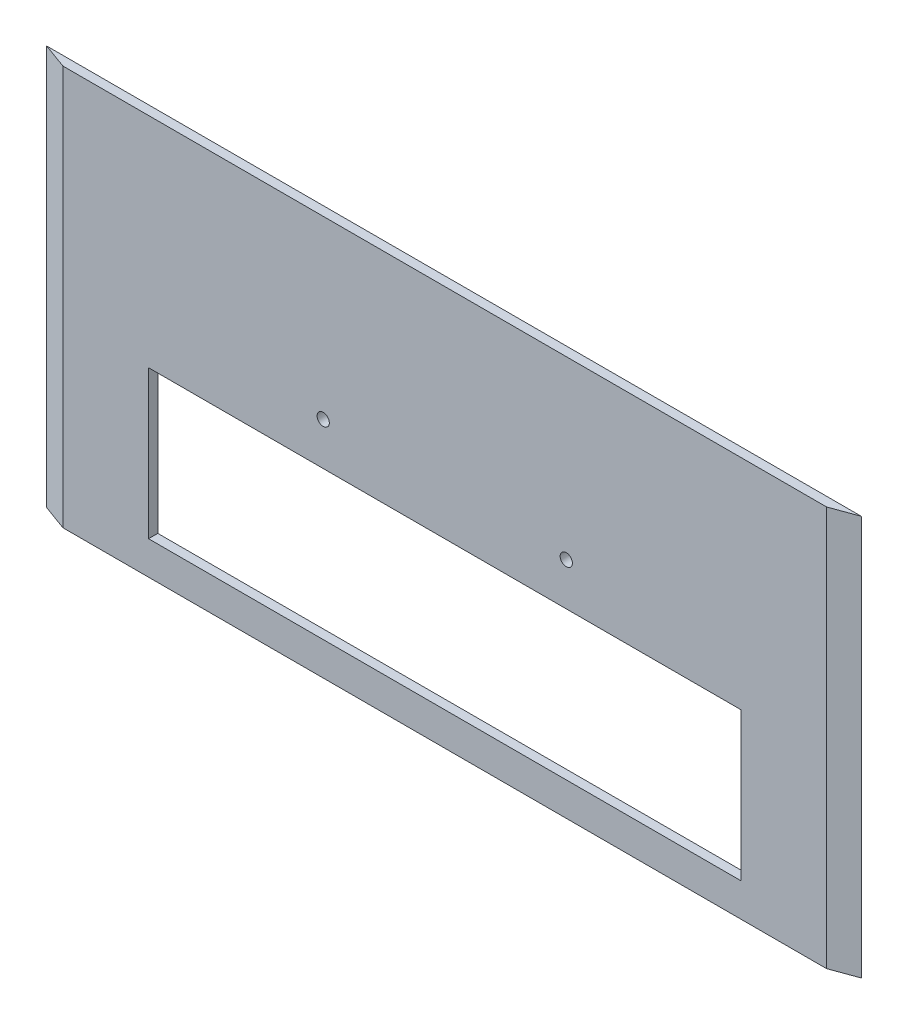
ISO-10303-21;
HEADER;
FILE_DESCRIPTION(('STEP AP214'),'2;1');
FILE_NAME('part.step','',(''),(''),'','','');
FILE_SCHEMA(('AUTOMOTIVE_DESIGN { 1 0 10303 214 1 1 1 1 }'));
ENDSEC;
DATA;
#1=APPLICATION_CONTEXT('core data for automotive mechanical design processes');
#2=APPLICATION_PROTOCOL_DEFINITION('international standard','automotive_design',2000,#1);
#3=PRODUCT_CONTEXT('',#1,'mechanical');
#4=PRODUCT('Part','Part','',(#3));
#5=PRODUCT_RELATED_PRODUCT_CATEGORY('part','',(#4));
#6=PRODUCT_DEFINITION_FORMATION('','',#4);
#7=PRODUCT_DEFINITION_CONTEXT('part definition',#1,'design');
#8=PRODUCT_DEFINITION('design','',#6,#7);
#9=PRODUCT_DEFINITION_SHAPE('','',#8);
#10=(LENGTH_UNIT() NAMED_UNIT(*) SI_UNIT(.MILLI.,.METRE.));
#11=(NAMED_UNIT(*) PLANE_ANGLE_UNIT() SI_UNIT($,.RADIAN.));
#12=(NAMED_UNIT(*) SI_UNIT($,.STERADIAN.) SOLID_ANGLE_UNIT());
#13=UNCERTAINTY_MEASURE_WITH_UNIT(LENGTH_MEASURE(1.E-05),#10,'distance_accuracy_value','');
#14=(GEOMETRIC_REPRESENTATION_CONTEXT(3) GLOBAL_UNCERTAINTY_ASSIGNED_CONTEXT((#13)) GLOBAL_UNIT_ASSIGNED_CONTEXT((#10,
#11,#12)) REPRESENTATION_CONTEXT('',''));
#15=CARTESIAN_POINT('',(0.,0.,0.));
#16=DIRECTION('',(0.,0.,1.));
#17=DIRECTION('',(1.,0.,0.));
#18=AXIS2_PLACEMENT_3D('',#15,#16,#17);
#19=CARTESIAN_POINT('',(-87.5,-31.5,2.5));
#20=DIRECTION('',(0.,1.,0.));
#21=DIRECTION('',(0.,0.,1.));
#22=AXIS2_PLACEMENT_3D('',#19,#20,#21);
#23=PLANE('',#22);
#24=DIRECTION('',(1.,0.,0.));
#25=VECTOR('',#24,1.);
#26=CARTESIAN_POINT('',(-87.5,-31.5,0.));
#27=LINE('',#26,#25);
#28=CARTESIAN_POINT('',(-110.,-31.5,0.));
#29=VERTEX_POINT('',#28);
#30=CARTESIAN_POINT('',(110.,-31.5,0.));
#31=VERTEX_POINT('',#30);
#32=EDGE_CURVE('E46',#29,#31,#27,.T.);
#33=ORIENTED_EDGE('',*,*,#32,.T.);
#34=DIRECTION('',(-0.939692620785911,0.,0.342020143325663));
#35=VECTOR('',#34,1.);
#36=CARTESIAN_POINT('',(103.131306451363,-31.5,2.5));
#37=LINE('',#36,#35);
#38=CARTESIAN_POINT('',(103.131306451363,-31.5,2.5));
#39=VERTEX_POINT('',#38);
#40=EDGE_CURVE('E129',#31,#39,#37,.T.);
#41=ORIENTED_EDGE('',*,*,#40,.T.);
#42=DIRECTION('',(1.,0.,0.));
#43=VECTOR('',#42,1.);
#44=CARTESIAN_POINT('',(-87.5,-31.5,2.5));
#45=LINE('',#44,#43);
#46=CARTESIAN_POINT('',(-103.131306451363,-31.5,2.5));
#47=VERTEX_POINT('',#46);
#48=EDGE_CURVE('E11',#47,#39,#45,.T.);
#49=ORIENTED_EDGE('',*,*,#48,.F.);
#50=DIRECTION('',(0.939692620785911,0.,0.342020143325663));
#51=VECTOR('',#50,1.);
#52=CARTESIAN_POINT('',(-103.131306451363,-31.5,2.5));
#53=LINE('',#52,#51);
#54=EDGE_CURVE('E135',#29,#47,#53,.T.);
#55=ORIENTED_EDGE('',*,*,#54,.F.);
#56=EDGE_LOOP('',(#33,#41,#49,#55));
#57=FACE_BOUND('',#56,.T.);
#58=ADVANCED_FACE('F43',(#57),#23,.F.);
#59=CARTESIAN_POINT('',(0.,0.,2.5));
#60=DIRECTION('',(0.,0.,-1.));
#61=DIRECTION('',(-1.,0.,0.));
#62=AXIS2_PLACEMENT_3D('',#59,#60,#61);
#63=PLANE('',#62);
#64=CARTESIAN_POINT('',(-32.825,29.0000000000001,2.5));
#65=DIRECTION('',(0.,0.,1.));
#66=DIRECTION('',(1.,0.,0.));
#67=AXIS2_PLACEMENT_3D('',#64,#65,#66);
#68=CIRCLE('',#67,1.65);
#69=CARTESIAN_POINT('',(-31.175,29.0000000000001,2.5));
#70=VERTEX_POINT('',#69);
#71=EDGE_CURVE('E230',#70,#70,#68,.T.);
#72=ORIENTED_EDGE('',*,*,#71,.F.);
#73=EDGE_LOOP('',(#72));
#74=FACE_BOUND('',#73,.T.);
#75=CARTESIAN_POINT('',(32.825,29.0000000000001,2.5));
#76=DIRECTION('',(0.,0.,-1.));
#77=DIRECTION('',(-1.,0.,0.));
#78=AXIS2_PLACEMENT_3D('',#75,#76,#77);
#79=CIRCLE('',#78,1.65);
#80=CARTESIAN_POINT('',(31.175,29.0000000000001,2.5));
#81=VERTEX_POINT('',#80);
#82=EDGE_CURVE('E131',#81,#81,#79,.T.);
#83=ORIENTED_EDGE('',*,*,#82,.T.);
#84=EDGE_LOOP('',(#83));
#85=FACE_BOUND('',#84,.T.);
#86=DIRECTION('',(-1.,0.,0.));
#87=VECTOR('',#86,1.);
#88=CARTESIAN_POINT('',(-80.,17.5,2.5));
#89=LINE('',#88,#87);
#90=CARTESIAN_POINT('',(80.,17.5,2.5));
#91=VERTEX_POINT('',#90);
#92=CARTESIAN_POINT('',(-80.,17.5,2.5));
#93=VERTEX_POINT('',#92);
#94=EDGE_CURVE('E158',#91,#93,#89,.T.);
#95=ORIENTED_EDGE('',*,*,#94,.F.);
#96=DIRECTION('',(0.,1.,0.));
#97=VECTOR('',#96,1.);
#98=CARTESIAN_POINT('',(80.,-22.5,2.5));
#99=LINE('',#98,#97);
#100=CARTESIAN_POINT('',(80.,-22.5,2.5));
#101=VERTEX_POINT('',#100);
#102=EDGE_CURVE('E57',#101,#91,#99,.T.);
#103=ORIENTED_EDGE('',*,*,#102,.F.);
#104=DIRECTION('',(1.,0.,0.));
#105=VECTOR('',#104,1.);
#106=CARTESIAN_POINT('',(-80.,-22.5,2.5));
#107=LINE('',#106,#105);
#108=CARTESIAN_POINT('',(-80.,-22.5,2.5));
#109=VERTEX_POINT('',#108);
#110=EDGE_CURVE('E149',#109,#101,#107,.T.);
#111=ORIENTED_EDGE('',*,*,#110,.F.);
#112=DIRECTION('',(0.,-1.,0.));
#113=VECTOR('',#112,1.);
#114=CARTESIAN_POINT('',(-80.,-22.5,2.5));
#115=LINE('',#114,#113);
#116=EDGE_CURVE('E161',#93,#109,#115,.T.);
#117=ORIENTED_EDGE('',*,*,#116,.F.);
#118=EDGE_LOOP('',(#95,#103,#111,#117));
#119=FACE_BOUND('',#118,.T.);
#120=ORIENTED_EDGE('',*,*,#48,.T.);
#121=DIRECTION('',(0.,-1.,0.));
#122=VECTOR('',#121,1.);
#123=CARTESIAN_POINT('',(103.131306451363,99.1384628453435,2.5));
#124=LINE('',#123,#122);
#125=CARTESIAN_POINT('',(103.131306451363,76.5,2.5));
#126=VERTEX_POINT('',#125);
#127=EDGE_CURVE('E125',#126,#39,#124,.T.);
#128=ORIENTED_EDGE('',*,*,#127,.F.);
#129=DIRECTION('',(-1.,0.,0.));
#130=VECTOR('',#129,1.);
#131=CARTESIAN_POINT('',(-87.5,76.5,2.5));
#132=LINE('',#131,#130);
#133=CARTESIAN_POINT('',(-103.131306451363,76.5,2.5));
#134=VERTEX_POINT('',#133);
#135=EDGE_CURVE('E117',#126,#134,#132,.T.);
#136=ORIENTED_EDGE('',*,*,#135,.T.);
#137=DIRECTION('',(0.,-1.,0.));
#138=VECTOR('',#137,1.);
#139=CARTESIAN_POINT('',(-103.131306451363,99.1384628453435,2.5));
#140=LINE('',#139,#138);
#141=EDGE_CURVE('E138',#134,#47,#140,.T.);
#142=ORIENTED_EDGE('',*,*,#141,.T.);
#143=EDGE_LOOP('',(#120,#128,#136,#142));
#144=FACE_BOUND('',#143,.T.);
#145=ADVANCED_FACE('F179',(#74,#85,#119,#144),#63,.F.);
#146=CARTESIAN_POINT('',(0.,0.,0.));
#147=DIRECTION('',(0.,0.,-1.));
#148=DIRECTION('',(-1.,0.,0.));
#149=AXIS2_PLACEMENT_3D('',#146,#147,#148);
#150=PLANE('',#149);
#151=CARTESIAN_POINT('',(-32.825,29.0000000000001,0.));
#152=DIRECTION('',(0.,0.,1.));
#153=DIRECTION('',(1.,0.,0.));
#154=AXIS2_PLACEMENT_3D('',#151,#152,#153);
#155=CIRCLE('',#154,1.65);
#156=CARTESIAN_POINT('',(-31.175,29.0000000000001,0.));
#157=VERTEX_POINT('',#156);
#158=EDGE_CURVE('E233',#157,#157,#155,.T.);
#159=ORIENTED_EDGE('',*,*,#158,.T.);
#160=EDGE_LOOP('',(#159));
#161=FACE_BOUND('',#160,.T.);
#162=CARTESIAN_POINT('',(32.825,29.0000000000001,0.));
#163=DIRECTION('',(0.,0.,-1.));
#164=DIRECTION('',(-1.,0.,0.));
#165=AXIS2_PLACEMENT_3D('',#162,#163,#164);
#166=CIRCLE('',#165,1.65);
#167=CARTESIAN_POINT('',(31.175,29.0000000000001,0.));
#168=VERTEX_POINT('',#167);
#169=EDGE_CURVE('E236',#168,#168,#166,.T.);
#170=ORIENTED_EDGE('',*,*,#169,.F.);
#171=EDGE_LOOP('',(#170));
#172=FACE_BOUND('',#171,.T.);
#173=DIRECTION('',(0.,1.,0.));
#174=VECTOR('',#173,1.);
#175=CARTESIAN_POINT('',(80.,-22.5,0.));
#176=LINE('',#175,#174);
#177=CARTESIAN_POINT('',(80.,-22.5,0.));
#178=VERTEX_POINT('',#177);
#179=CARTESIAN_POINT('',(80.,17.5,0.));
#180=VERTEX_POINT('',#179);
#181=EDGE_CURVE('E145',#178,#180,#176,.T.);
#182=ORIENTED_EDGE('',*,*,#181,.T.);
#183=DIRECTION('',(-1.,0.,0.));
#184=VECTOR('',#183,1.);
#185=CARTESIAN_POINT('',(-80.,17.5,0.));
#186=LINE('',#185,#184);
#187=CARTESIAN_POINT('',(-80.,17.5,0.));
#188=VERTEX_POINT('',#187);
#189=EDGE_CURVE('E148',#180,#188,#186,.T.);
#190=ORIENTED_EDGE('',*,*,#189,.T.);
#191=DIRECTION('',(0.,-1.,0.));
#192=VECTOR('',#191,1.);
#193=CARTESIAN_POINT('',(-80.,-22.5,0.));
#194=LINE('',#193,#192);
#195=CARTESIAN_POINT('',(-80.,-22.5,0.));
#196=VERTEX_POINT('',#195);
#197=EDGE_CURVE('E65',#188,#196,#194,.T.);
#198=ORIENTED_EDGE('',*,*,#197,.T.);
#199=DIRECTION('',(1.,0.,0.));
#200=VECTOR('',#199,1.);
#201=CARTESIAN_POINT('',(-80.,-22.5,0.));
#202=LINE('',#201,#200);
#203=EDGE_CURVE('E153',#196,#178,#202,.T.);
#204=ORIENTED_EDGE('',*,*,#203,.T.);
#205=EDGE_LOOP('',(#182,#190,#198,#204));
#206=FACE_BOUND('',#205,.T.);
#207=DIRECTION('',(-1.,0.,0.));
#208=VECTOR('',#207,1.);
#209=CARTESIAN_POINT('',(-87.5,76.5,0.));
#210=LINE('',#209,#208);
#211=CARTESIAN_POINT('',(110.,76.5,0.));
#212=VERTEX_POINT('',#211);
#213=CARTESIAN_POINT('',(-110.,76.5,0.));
#214=VERTEX_POINT('',#213);
#215=EDGE_CURVE('E106',#212,#214,#210,.T.);
#216=ORIENTED_EDGE('',*,*,#215,.F.);
#217=DIRECTION('',(0.,-1.,0.));
#218=VECTOR('',#217,1.);
#219=CARTESIAN_POINT('',(110.,99.1384628453435,0.));
#220=LINE('',#219,#218);
#221=EDGE_CURVE('E110',#212,#31,#220,.T.);
#222=ORIENTED_EDGE('',*,*,#221,.T.);
#223=ORIENTED_EDGE('',*,*,#32,.F.);
#224=DIRECTION('',(0.,-1.,0.));
#225=VECTOR('',#224,1.);
#226=CARTESIAN_POINT('',(-110.,99.1384628453435,0.));
#227=LINE('',#226,#225);
#228=EDGE_CURVE('E113',#214,#29,#227,.T.);
#229=ORIENTED_EDGE('',*,*,#228,.F.);
#230=EDGE_LOOP('',(#216,#222,#223,#229));
#231=FACE_BOUND('',#230,.T.);
#232=ADVANCED_FACE('F108',(#161,#172,#206,#231),#150,.T.);
#233=CARTESIAN_POINT('',(80.,-22.5,0.));
#234=DIRECTION('',(1.,0.,0.));
#235=DIRECTION('',(0.,0.,-1.));
#236=AXIS2_PLACEMENT_3D('',#233,#234,#235);
#237=PLANE('',#236);
#238=ORIENTED_EDGE('',*,*,#102,.T.);
#239=DIRECTION('',(0.,0.,1.));
#240=VECTOR('',#239,1.);
#241=CARTESIAN_POINT('',(80.,17.5,0.));
#242=LINE('',#241,#240);
#243=EDGE_CURVE('E156',#180,#91,#242,.T.);
#244=ORIENTED_EDGE('',*,*,#243,.F.);
#245=ORIENTED_EDGE('',*,*,#181,.F.);
#246=DIRECTION('',(0.,0.,1.));
#247=VECTOR('',#246,1.);
#248=CARTESIAN_POINT('',(80.,-22.5,0.));
#249=LINE('',#248,#247);
#250=EDGE_CURVE('E166',#178,#101,#249,.T.);
#251=ORIENTED_EDGE('',*,*,#250,.T.);
#252=EDGE_LOOP('',(#238,#244,#245,#251));
#253=FACE_BOUND('',#252,.T.);
#254=ADVANCED_FACE('F185',(#253),#237,.F.);
#255=CARTESIAN_POINT('',(-80.,-22.5,0.));
#256=DIRECTION('',(0.,-1.,0.));
#257=DIRECTION('',(0.,0.,-1.));
#258=AXIS2_PLACEMENT_3D('',#255,#256,#257);
#259=PLANE('',#258);
#260=ORIENTED_EDGE('',*,*,#110,.T.);
#261=ORIENTED_EDGE('',*,*,#250,.F.);
#262=ORIENTED_EDGE('',*,*,#203,.F.);
#263=DIRECTION('',(0.,0.,1.));
#264=VECTOR('',#263,1.);
#265=CARTESIAN_POINT('',(-80.,-22.5,0.));
#266=LINE('',#265,#264);
#267=EDGE_CURVE('E168',#196,#109,#266,.T.);
#268=ORIENTED_EDGE('',*,*,#267,.T.);
#269=EDGE_LOOP('',(#260,#261,#262,#268));
#270=FACE_BOUND('',#269,.T.);
#271=ADVANCED_FACE('F187',(#270),#259,.F.);
#272=CARTESIAN_POINT('',(-80.,-22.5,0.));
#273=DIRECTION('',(-1.,0.,0.));
#274=DIRECTION('',(0.,0.,1.));
#275=AXIS2_PLACEMENT_3D('',#272,#273,#274);
#276=PLANE('',#275);
#277=ORIENTED_EDGE('',*,*,#116,.T.);
#278=ORIENTED_EDGE('',*,*,#267,.F.);
#279=ORIENTED_EDGE('',*,*,#197,.F.);
#280=DIRECTION('',(0.,0.,1.));
#281=VECTOR('',#280,1.);
#282=CARTESIAN_POINT('',(-80.,17.5,0.));
#283=LINE('',#282,#281);
#284=EDGE_CURVE('E170',#188,#93,#283,.T.);
#285=ORIENTED_EDGE('',*,*,#284,.T.);
#286=EDGE_LOOP('',(#277,#278,#279,#285));
#287=FACE_BOUND('',#286,.T.);
#288=ADVANCED_FACE('F182',(#287),#276,.F.);
#289=CARTESIAN_POINT('',(-80.,17.5,0.));
#290=DIRECTION('',(0.,1.,0.));
#291=DIRECTION('',(0.,0.,1.));
#292=AXIS2_PLACEMENT_3D('',#289,#290,#291);
#293=PLANE('',#292);
#294=ORIENTED_EDGE('',*,*,#94,.T.);
#295=ORIENTED_EDGE('',*,*,#284,.F.);
#296=ORIENTED_EDGE('',*,*,#189,.F.);
#297=ORIENTED_EDGE('',*,*,#243,.T.);
#298=EDGE_LOOP('',(#294,#295,#296,#297));
#299=FACE_BOUND('',#298,.T.);
#300=ADVANCED_FACE('F175',(#299),#293,.F.);
#301=CARTESIAN_POINT('',(-87.5,76.5,-180.693109995927));
#302=DIRECTION('',(0.,1.,0.));
#303=DIRECTION('',(0.,0.,1.));
#304=AXIS2_PLACEMENT_3D('',#301,#302,#303);
#305=PLANE('',#304);
#306=ORIENTED_EDGE('',*,*,#135,.F.);
#307=DIRECTION('',(-0.939692620785911,0.,0.342020143325663));
#308=VECTOR('',#307,1.);
#309=CARTESIAN_POINT('',(103.131306451363,76.5,2.5));
#310=LINE('',#309,#308);
#311=EDGE_CURVE('E120',#212,#126,#310,.T.);
#312=ORIENTED_EDGE('',*,*,#311,.F.);
#313=ORIENTED_EDGE('',*,*,#215,.T.);
#314=DIRECTION('',(0.939692620785911,0.,0.342020143325663));
#315=VECTOR('',#314,1.);
#316=CARTESIAN_POINT('',(-103.131306451363,76.5,2.5));
#317=LINE('',#316,#315);
#318=EDGE_CURVE('E139',#214,#134,#317,.T.);
#319=ORIENTED_EDGE('',*,*,#318,.T.);
#320=EDGE_LOOP('',(#306,#312,#313,#319));
#321=FACE_BOUND('',#320,.T.);
#322=ADVANCED_FACE('F121',(#321),#305,.T.);
#323=CARTESIAN_POINT('',(-103.131306451363,99.1384628453435,2.5));
#324=DIRECTION('',(0.342020143325663,0.,-0.939692620785911));
#325=DIRECTION('',(-0.939692620785911,0.,-0.342020143325663));
#326=AXIS2_PLACEMENT_3D('',#323,#324,#325);
#327=PLANE('',#326);
#328=ORIENTED_EDGE('',*,*,#318,.F.);
#329=ORIENTED_EDGE('',*,*,#228,.T.);
#330=ORIENTED_EDGE('',*,*,#54,.T.);
#331=ORIENTED_EDGE('',*,*,#141,.F.);
#332=EDGE_LOOP('',(#328,#329,#330,#331));
#333=FACE_BOUND('',#332,.T.);
#334=ADVANCED_FACE('F208',(#333),#327,.F.);
#335=CARTESIAN_POINT('',(103.131306451363,99.1384628453435,2.5));
#336=DIRECTION('',(0.342020143325663,0.,0.939692620785911));
#337=DIRECTION('',(0.939692620785911,0.,-0.342020143325663));
#338=AXIS2_PLACEMENT_3D('',#335,#336,#337);
#339=PLANE('',#338);
#340=ORIENTED_EDGE('',*,*,#221,.F.);
#341=ORIENTED_EDGE('',*,*,#311,.T.);
#342=ORIENTED_EDGE('',*,*,#127,.T.);
#343=ORIENTED_EDGE('',*,*,#40,.F.);
#344=EDGE_LOOP('',(#340,#341,#342,#343));
#345=FACE_BOUND('',#344,.T.);
#346=ADVANCED_FACE('F127',(#345),#339,.T.);
#347=CARTESIAN_POINT('',(32.825,29.0000000000001,2.5));
#348=DIRECTION('',(0.,0.,-1.));
#349=DIRECTION('',(-1.,0.,0.));
#350=AXIS2_PLACEMENT_3D('',#347,#348,#349);
#351=CYLINDRICAL_SURFACE('',#350,1.65);
#352=ORIENTED_EDGE('',*,*,#82,.F.);
#353=EDGE_LOOP('',(#352));
#354=FACE_BOUND('',#353,.T.);
#355=ORIENTED_EDGE('',*,*,#169,.T.);
#356=EDGE_LOOP('',(#355));
#357=FACE_BOUND('',#356,.T.);
#358=ADVANCED_FACE('F215',(#354,#357),#351,.F.);
#359=CARTESIAN_POINT('',(-32.825,29.0000000000001,2.5));
#360=DIRECTION('',(0.,0.,-1.));
#361=DIRECTION('',(-1.,0.,0.));
#362=AXIS2_PLACEMENT_3D('',#359,#360,#361);
#363=CYLINDRICAL_SURFACE('',#362,1.65);
#364=ORIENTED_EDGE('',*,*,#71,.T.);
#365=EDGE_LOOP('',(#364));
#366=FACE_BOUND('',#365,.T.);
#367=ORIENTED_EDGE('',*,*,#158,.F.);
#368=EDGE_LOOP('',(#367));
#369=FACE_BOUND('',#368,.T.);
#370=ADVANCED_FACE('F220',(#366,#369),#363,.F.);
#371=CLOSED_SHELL('',(#58,#145,#232,#254,#271,#288,#300,#322,#334,#346,#358,#370));
#372=MANIFOLD_SOLID_BREP('B2',#371);
#373=ADVANCED_BREP_SHAPE_REPRESENTATION('',(#18,#372),#14);
#374=SHAPE_DEFINITION_REPRESENTATION(#9,#373);
ENDSEC;
END-ISO-10303-21;
